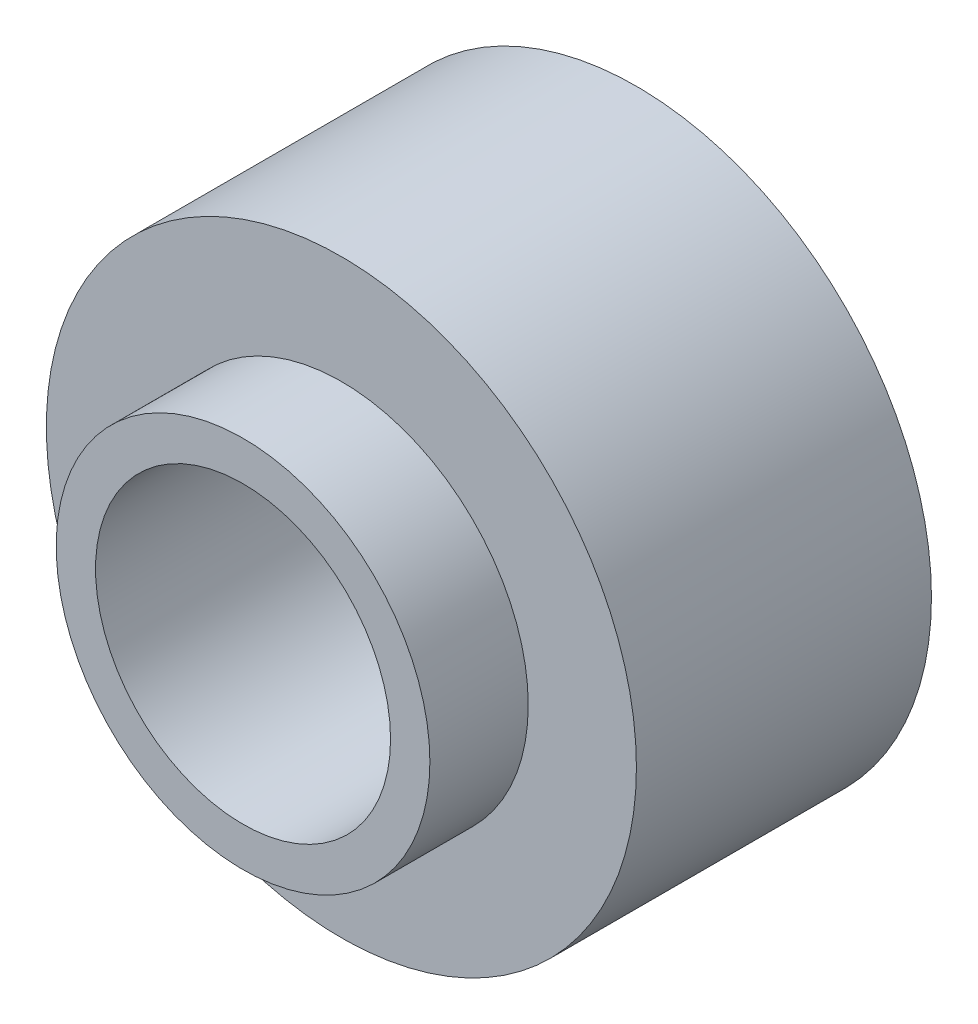
ISO-10303-21;
HEADER;
FILE_DESCRIPTION(('STEP AP214'),'2;1');
FILE_NAME('part.step','',(''),(''),'','','');
FILE_SCHEMA(('AUTOMOTIVE_DESIGN { 1 0 10303 214 1 1 1 1 }'));
ENDSEC;
DATA;
#1=APPLICATION_CONTEXT('core data for automotive mechanical design processes');
#2=APPLICATION_PROTOCOL_DEFINITION('international standard','automotive_design',2000,#1);
#3=PRODUCT_CONTEXT('',#1,'mechanical');
#4=PRODUCT('Part','Part','',(#3));
#5=PRODUCT_RELATED_PRODUCT_CATEGORY('part','',(#4));
#6=PRODUCT_DEFINITION_FORMATION('','',#4);
#7=PRODUCT_DEFINITION_CONTEXT('part definition',#1,'design');
#8=PRODUCT_DEFINITION('design','',#6,#7);
#9=PRODUCT_DEFINITION_SHAPE('','',#8);
#10=(LENGTH_UNIT() NAMED_UNIT(*) SI_UNIT(.MILLI.,.METRE.));
#11=(NAMED_UNIT(*) PLANE_ANGLE_UNIT() SI_UNIT($,.RADIAN.));
#12=(NAMED_UNIT(*) SI_UNIT($,.STERADIAN.) SOLID_ANGLE_UNIT());
#13=UNCERTAINTY_MEASURE_WITH_UNIT(LENGTH_MEASURE(1.E-05),#10,'distance_accuracy_value','');
#14=(GEOMETRIC_REPRESENTATION_CONTEXT(3) GLOBAL_UNCERTAINTY_ASSIGNED_CONTEXT((#13)) GLOBAL_UNIT_ASSIGNED_CONTEXT((#10,
#11,#12)) REPRESENTATION_CONTEXT('',''));
#15=CARTESIAN_POINT('',(0.,0.,0.));
#16=DIRECTION('',(0.,0.,1.));
#17=DIRECTION('',(1.,0.,0.));
#18=AXIS2_PLACEMENT_3D('',#15,#16,#17);
#19=CARTESIAN_POINT('',(0.,0.,12.7));
#20=DIRECTION('',(0.,0.,1.));
#21=DIRECTION('',(1.,0.,0.));
#22=AXIS2_PLACEMENT_3D('',#19,#20,#21);
#23=PLANE('',#22);
#24=CARTESIAN_POINT('',(0.,0.,12.7));
#25=DIRECTION('',(0.,0.,1.));
#26=DIRECTION('',(1.,0.,0.));
#27=AXIS2_PLACEMENT_3D('',#24,#25,#26);
#28=CIRCLE('',#27,4.7625);
#29=CARTESIAN_POINT('',(4.7625,0.,12.7));
#30=VERTEX_POINT('',#29);
#31=EDGE_CURVE('E38',#30,#30,#28,.T.);
#32=ORIENTED_EDGE('',*,*,#31,.F.);
#33=EDGE_LOOP('',(#32));
#34=FACE_BOUND('',#33,.T.);
#35=CARTESIAN_POINT('',(0.,0.,12.7));
#36=DIRECTION('',(0.,0.,1.));
#37=DIRECTION('',(1.,0.,0.));
#38=AXIS2_PLACEMENT_3D('',#35,#36,#37);
#39=CIRCLE('',#38,6.0325);
#40=CARTESIAN_POINT('',(6.0325,0.,12.7));
#41=VERTEX_POINT('',#40);
#42=EDGE_CURVE('E52',#41,#41,#39,.T.);
#43=ORIENTED_EDGE('',*,*,#42,.T.);
#44=EDGE_LOOP('',(#43));
#45=FACE_BOUND('',#44,.T.);
#46=ADVANCED_FACE('F31',(#34,#45),#23,.T.);
#47=CARTESIAN_POINT('',(0.,0.,12.7));
#48=DIRECTION('',(0.,0.,-1.));
#49=DIRECTION('',(-1.,0.,0.));
#50=AXIS2_PLACEMENT_3D('',#47,#48,#49);
#51=CYLINDRICAL_SURFACE('',#50,9.525);
#52=CARTESIAN_POINT('',(0.,0.,0.));
#53=DIRECTION('',(0.,0.,1.));
#54=DIRECTION('',(1.,0.,0.));
#55=AXIS2_PLACEMENT_3D('',#52,#53,#54);
#56=CIRCLE('',#55,9.525);
#57=CARTESIAN_POINT('',(9.525,0.,0.));
#58=VERTEX_POINT('',#57);
#59=EDGE_CURVE('E10',#58,#58,#56,.T.);
#60=ORIENTED_EDGE('',*,*,#59,.T.);
#61=EDGE_LOOP('',(#60));
#62=FACE_BOUND('',#61,.T.);
#63=CARTESIAN_POINT('',(0.,0.,9.525));
#64=DIRECTION('',(0.,0.,1.));
#65=DIRECTION('',(1.,0.,0.));
#66=AXIS2_PLACEMENT_3D('',#63,#64,#65);
#67=CIRCLE('',#66,9.525);
#68=CARTESIAN_POINT('',(9.525,0.,9.525));
#69=VERTEX_POINT('',#68);
#70=EDGE_CURVE('E47',#69,#69,#67,.T.);
#71=ORIENTED_EDGE('',*,*,#70,.F.);
#72=EDGE_LOOP('',(#71));
#73=FACE_BOUND('',#72,.T.);
#74=ADVANCED_FACE('F33',(#62,#73),#51,.T.);
#75=CARTESIAN_POINT('',(0.,0.,0.));
#76=DIRECTION('',(0.,0.,1.));
#77=DIRECTION('',(1.,0.,0.));
#78=AXIS2_PLACEMENT_3D('',#75,#76,#77);
#79=PLANE('',#78);
#80=ORIENTED_EDGE('',*,*,#59,.F.);
#81=EDGE_LOOP('',(#80));
#82=FACE_BOUND('',#81,.T.);
#83=CARTESIAN_POINT('',(0.,0.,0.));
#84=DIRECTION('',(0.,0.,1.));
#85=DIRECTION('',(1.,0.,0.));
#86=AXIS2_PLACEMENT_3D('',#83,#84,#85);
#87=CIRCLE('',#86,4.7625);
#88=CARTESIAN_POINT('',(4.7625,0.,0.));
#89=VERTEX_POINT('',#88);
#90=EDGE_CURVE('E42',#89,#89,#87,.T.);
#91=ORIENTED_EDGE('',*,*,#90,.T.);
#92=EDGE_LOOP('',(#91));
#93=FACE_BOUND('',#92,.T.);
#94=ADVANCED_FACE('F69',(#82,#93),#79,.F.);
#95=CARTESIAN_POINT('',(0.,0.,12.7));
#96=DIRECTION('',(0.,0.,-1.));
#97=DIRECTION('',(-1.,0.,0.));
#98=AXIS2_PLACEMENT_3D('',#95,#96,#97);
#99=CYLINDRICAL_SURFACE('',#98,4.7625);
#100=ORIENTED_EDGE('',*,*,#31,.T.);
#101=EDGE_LOOP('',(#100));
#102=FACE_BOUND('',#101,.T.);
#103=ORIENTED_EDGE('',*,*,#90,.F.);
#104=EDGE_LOOP('',(#103));
#105=FACE_BOUND('',#104,.T.);
#106=ADVANCED_FACE('F64',(#102,#105),#99,.F.);
#107=CARTESIAN_POINT('',(0.,0.,9.525));
#108=DIRECTION('',(0.,0.,1.));
#109=DIRECTION('',(1.,0.,0.));
#110=AXIS2_PLACEMENT_3D('',#107,#108,#109);
#111=PLANE('',#110);
#112=CARTESIAN_POINT('',(0.,0.,9.525));
#113=DIRECTION('',(0.,0.,1.));
#114=DIRECTION('',(1.,0.,0.));
#115=AXIS2_PLACEMENT_3D('',#112,#113,#114);
#116=CIRCLE('',#115,6.0325);
#117=CARTESIAN_POINT('',(6.0325,0.,9.525));
#118=VERTEX_POINT('',#117);
#119=EDGE_CURVE('E51',#118,#118,#116,.T.);
#120=ORIENTED_EDGE('',*,*,#119,.F.);
#121=EDGE_LOOP('',(#120));
#122=FACE_BOUND('',#121,.T.);
#123=ORIENTED_EDGE('',*,*,#70,.T.);
#124=EDGE_LOOP('',(#123));
#125=FACE_BOUND('',#124,.T.);
#126=ADVANCED_FACE('F61',(#122,#125),#111,.T.);
#127=CARTESIAN_POINT('',(0.,0.,9.525));
#128=DIRECTION('',(0.,0.,1.));
#129=DIRECTION('',(1.,0.,0.));
#130=AXIS2_PLACEMENT_3D('',#127,#128,#129);
#131=CYLINDRICAL_SURFACE('',#130,6.0325);
#132=ORIENTED_EDGE('',*,*,#119,.T.);
#133=EDGE_LOOP('',(#132));
#134=FACE_BOUND('',#133,.T.);
#135=ORIENTED_EDGE('',*,*,#42,.F.);
#136=EDGE_LOOP('',(#135));
#137=FACE_BOUND('',#136,.T.);
#138=ADVANCED_FACE('F58',(#134,#137),#131,.T.);
#139=CLOSED_SHELL('',(#46,#74,#94,#106,#126,#138));
#140=MANIFOLD_SOLID_BREP('B2',#139);
#141=ADVANCED_BREP_SHAPE_REPRESENTATION('',(#18,#140),#14);
#142=SHAPE_DEFINITION_REPRESENTATION(#9,#141);
ENDSEC;
END-ISO-10303-21;
